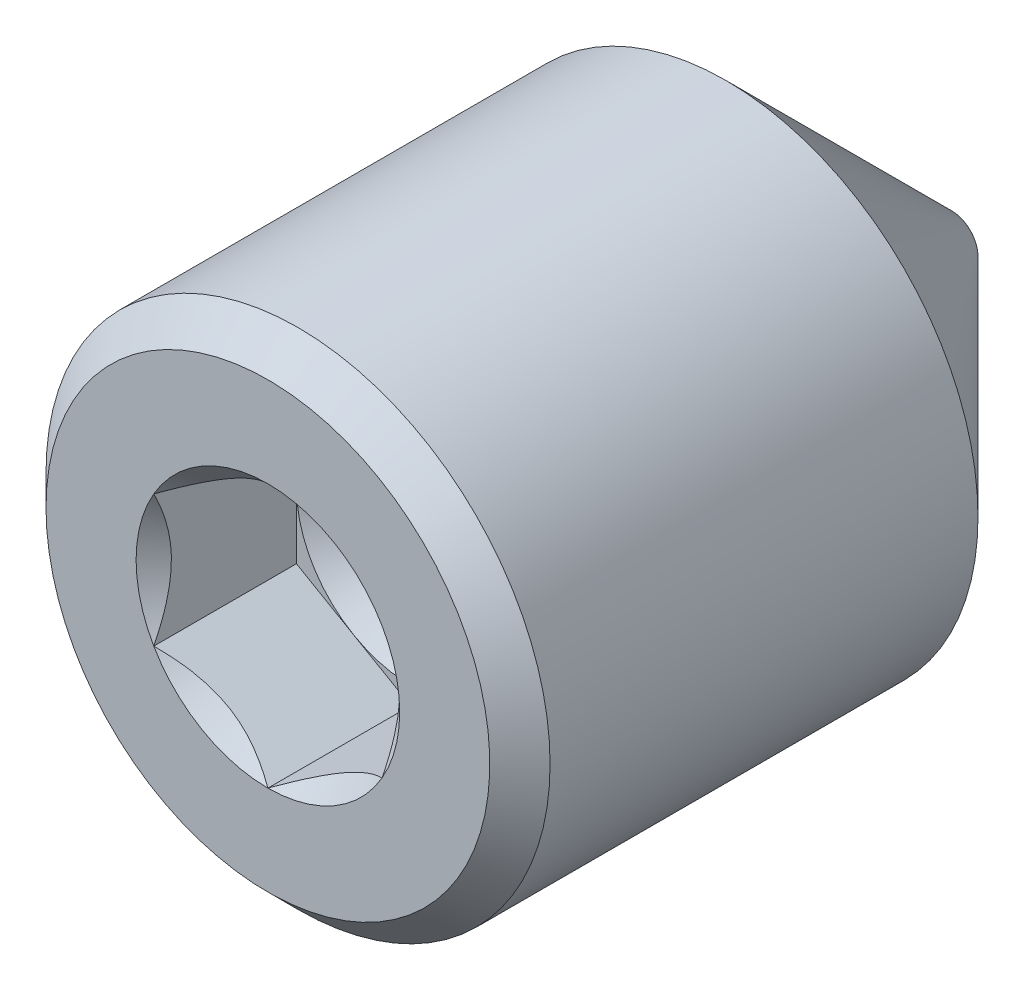
ISO-10303-21;
HEADER;
FILE_DESCRIPTION(('STEP AP214'),'2;1');
FILE_NAME('part.step','',(''),(''),'','','');
FILE_SCHEMA(('AUTOMOTIVE_DESIGN { 1 0 10303 214 1 1 1 1 }'));
ENDSEC;
DATA;
#1=APPLICATION_CONTEXT('core data for automotive mechanical design processes');
#2=APPLICATION_PROTOCOL_DEFINITION('international standard','automotive_design',2000,#1);
#3=PRODUCT_CONTEXT('',#1,'mechanical');
#4=PRODUCT('Part','Part','',(#3));
#5=PRODUCT_RELATED_PRODUCT_CATEGORY('part','',(#4));
#6=PRODUCT_DEFINITION_FORMATION('','',#4);
#7=PRODUCT_DEFINITION_CONTEXT('part definition',#1,'design');
#8=PRODUCT_DEFINITION('design','',#6,#7);
#9=PRODUCT_DEFINITION_SHAPE('','',#8);
#10=(LENGTH_UNIT() NAMED_UNIT(*) SI_UNIT(.MILLI.,.METRE.));
#11=(NAMED_UNIT(*) PLANE_ANGLE_UNIT() SI_UNIT($,.RADIAN.));
#12=(NAMED_UNIT(*) SI_UNIT($,.STERADIAN.) SOLID_ANGLE_UNIT());
#13=UNCERTAINTY_MEASURE_WITH_UNIT(LENGTH_MEASURE(1.E-05),#10,'distance_accuracy_value','');
#14=(GEOMETRIC_REPRESENTATION_CONTEXT(3) GLOBAL_UNCERTAINTY_ASSIGNED_CONTEXT((#13)) GLOBAL_UNIT_ASSIGNED_CONTEXT((#10,
#11,#12)) REPRESENTATION_CONTEXT('',''));
#15=CARTESIAN_POINT('',(0.,0.,0.));
#16=DIRECTION('',(0.,0.,1.));
#17=DIRECTION('',(1.,0.,0.));
#18=AXIS2_PLACEMENT_3D('',#15,#16,#17);
#19=CARTESIAN_POINT('',(0.,0.,1.3890625));
#20=DIRECTION('',(0.,0.,1.));
#21=DIRECTION('',(1.,0.,0.));
#22=AXIS2_PLACEMENT_3D('',#19,#20,#21);
#23=PLANE('',#22);
#24=CARTESIAN_POINT('',(0.,0.,1.3890625));
#25=DIRECTION('',(0.,0.,1.));
#26=DIRECTION('',(1.,0.,0.));
#27=AXIS2_PLACEMENT_3D('',#24,#25,#26);
#28=CIRCLE('',#27,0.793750000000001);
#29=CARTESIAN_POINT('',(0.793750000000002,0.,1.3890625));
#30=VERTEX_POINT('',#29);
#31=CARTESIAN_POINT('',(0.396875,0.687407664253899,1.3890625));
#32=VERTEX_POINT('',#31);
#33=EDGE_CURVE('E120',#30,#32,#28,.T.);
#34=ORIENTED_EDGE('',*,*,#33,.F.);
#35=DIRECTION('',(0.,1.,0.));
#36=VECTOR('',#35,1.);
#37=CARTESIAN_POINT('',(0.793750000000002,-0.458271776169265,1.3890625));
#38=LINE('',#37,#36);
#39=CARTESIAN_POINT('',(0.793750000000002,0.458271776169266,1.3890625));
#40=VERTEX_POINT('',#39);
#41=EDGE_CURVE('E152',#30,#40,#38,.T.);
#42=ORIENTED_EDGE('',*,*,#41,.T.);
#43=DIRECTION('',(-0.866025403784439,0.5,0.));
#44=VECTOR('',#43,1.);
#45=CARTESIAN_POINT('',(0.793750000000002,0.458271776169266,1.3890625));
#46=LINE('',#45,#44);
#47=EDGE_CURVE('E145',#40,#32,#46,.T.);
#48=ORIENTED_EDGE('',*,*,#47,.T.);
#49=EDGE_LOOP('',(#34,#42,#48));
#50=FACE_BOUND('',#49,.T.);
#51=ADVANCED_FACE('F41',(#50),#23,.T.);
#52=CARTESIAN_POINT('',(-0.396875000000001,0.6874076642539,1.3890625));
#53=VERTEX_POINT('',#52);
#54=EDGE_CURVE('E122',#32,#53,#28,.T.);
#55=ORIENTED_EDGE('',*,*,#54,.F.);
#56=CARTESIAN_POINT('',(0.,0.916543552338532,1.3890625));
#57=VERTEX_POINT('',#56);
#58=EDGE_CURVE('E135',#32,#57,#46,.T.);
#59=ORIENTED_EDGE('',*,*,#58,.T.);
#60=DIRECTION('',(-0.866025403784439,-0.5,0.));
#61=VECTOR('',#60,1.);
#62=CARTESIAN_POINT('',(0.,0.916543552338532,1.3890625));
#63=LINE('',#62,#61);
#64=EDGE_CURVE('E138',#57,#53,#63,.T.);
#65=ORIENTED_EDGE('',*,*,#64,.T.);
#66=EDGE_LOOP('',(#55,#59,#65));
#67=FACE_BOUND('',#66,.T.);
#68=ADVANCED_FACE('F134',(#67),#23,.T.);
#69=CARTESIAN_POINT('',(-0.793750000000001,0.,1.3890625));
#70=VERTEX_POINT('',#69);
#71=EDGE_CURVE('E140',#53,#70,#28,.T.);
#72=ORIENTED_EDGE('',*,*,#71,.F.);
#73=CARTESIAN_POINT('',(-0.793750000000001,0.458271776169266,1.3890625));
#74=VERTEX_POINT('',#73);
#75=EDGE_CURVE('E155',#53,#74,#63,.T.);
#76=ORIENTED_EDGE('',*,*,#75,.T.);
#77=DIRECTION('',(0.,-1.,0.));
#78=VECTOR('',#77,1.);
#79=CARTESIAN_POINT('',(-0.793750000000001,0.458271776169266,1.3890625));
#80=LINE('',#79,#78);
#81=EDGE_CURVE('E163',#74,#70,#80,.T.);
#82=ORIENTED_EDGE('',*,*,#81,.T.);
#83=EDGE_LOOP('',(#72,#76,#82));
#84=FACE_BOUND('',#83,.T.);
#85=ADVANCED_FACE('F284',(#84),#23,.T.);
#86=CARTESIAN_POINT('',(-0.396875,-0.687407664253899,1.3890625));
#87=VERTEX_POINT('',#86);
#88=EDGE_CURVE('E309',#70,#87,#28,.T.);
#89=ORIENTED_EDGE('',*,*,#88,.F.);
#90=CARTESIAN_POINT('',(-0.793750000000001,-0.458271776169265,1.3890625));
#91=VERTEX_POINT('',#90);
#92=EDGE_CURVE('E162',#70,#91,#80,.T.);
#93=ORIENTED_EDGE('',*,*,#92,.T.);
#94=DIRECTION('',(0.866025403784439,-0.5,0.));
#95=VECTOR('',#94,1.);
#96=CARTESIAN_POINT('',(-0.793750000000001,-0.458271776169265,1.3890625));
#97=LINE('',#96,#95);
#98=EDGE_CURVE('E313',#91,#87,#97,.T.);
#99=ORIENTED_EDGE('',*,*,#98,.T.);
#100=EDGE_LOOP('',(#89,#93,#99));
#101=FACE_BOUND('',#100,.T.);
#102=ADVANCED_FACE('F292',(#101),#23,.T.);
#103=CARTESIAN_POINT('',(0.396875,-0.687407664253898,1.3890625));
#104=VERTEX_POINT('',#103);
#105=EDGE_CURVE('E57',#87,#104,#28,.T.);
#106=ORIENTED_EDGE('',*,*,#105,.F.);
#107=CARTESIAN_POINT('',(0.,-0.916543552338531,1.3890625));
#108=VERTEX_POINT('',#107);
#109=EDGE_CURVE('E304',#87,#108,#97,.T.);
#110=ORIENTED_EDGE('',*,*,#109,.T.);
#111=DIRECTION('',(0.866025403784438,0.5,0.));
#112=VECTOR('',#111,1.);
#113=CARTESIAN_POINT('',(0.,-0.916543552338531,1.3890625));
#114=LINE('',#113,#112);
#115=EDGE_CURVE('E307',#108,#104,#114,.T.);
#116=ORIENTED_EDGE('',*,*,#115,.T.);
#117=EDGE_LOOP('',(#106,#110,#116));
#118=FACE_BOUND('',#117,.T.);
#119=ADVANCED_FACE('F287',(#118),#23,.T.);
#120=CARTESIAN_POINT('',(0.,1.7526,2.38125));
#121=DIRECTION('',(0.,0.,-1.));
#122=DIRECTION('',(-1.,0.,0.));
#123=AXIS2_PLACEMENT_3D('',#120,#121,#122);
#124=PLANE('',#123);
#125=CARTESIAN_POINT('',(0.,0.,2.38125));
#126=DIRECTION('',(0.,0.,1.));
#127=DIRECTION('',(1.,0.,0.));
#128=AXIS2_PLACEMENT_3D('',#125,#126,#127);
#129=CIRCLE('',#128,0.916543552338532);
#130=CARTESIAN_POINT('',(-0.793750000000001,0.458271776169266,2.38125));
#131=VERTEX_POINT('',#130);
#132=CARTESIAN_POINT('',(-0.793750000000001,-0.458271776169267,2.38125));
#133=VERTEX_POINT('',#132);
#134=EDGE_CURVE('E64',#131,#133,#129,.T.);
#135=ORIENTED_EDGE('',*,*,#134,.F.);
#136=CARTESIAN_POINT('',(0.,0.916543552338532,2.38125));
#137=VERTEX_POINT('',#136);
#138=EDGE_CURVE('E338',#137,#131,#129,.T.);
#139=ORIENTED_EDGE('',*,*,#138,.F.);
#140=CARTESIAN_POINT('',(0.793750000000002,0.458271776169266,2.38125));
#141=VERTEX_POINT('',#140);
#142=EDGE_CURVE('E334',#141,#137,#129,.T.);
#143=ORIENTED_EDGE('',*,*,#142,.F.);
#144=CARTESIAN_POINT('',(0.793750000000003,-0.458271776169264,2.38125));
#145=VERTEX_POINT('',#144);
#146=EDGE_CURVE('E129',#145,#141,#129,.T.);
#147=ORIENTED_EDGE('',*,*,#146,.F.);
#148=CARTESIAN_POINT('',(0.,-0.916543552338532,2.38125));
#149=VERTEX_POINT('',#148);
#150=EDGE_CURVE('E345',#149,#145,#129,.T.);
#151=ORIENTED_EDGE('',*,*,#150,.F.);
#152=EDGE_CURVE('E349',#133,#149,#129,.T.);
#153=ORIENTED_EDGE('',*,*,#152,.F.);
#154=EDGE_LOOP('',(#135,#139,#143,#147,#151,#153));
#155=FACE_BOUND('',#154,.T.);
#156=CARTESIAN_POINT('',(0.,0.,2.38125));
#157=DIRECTION('',(0.,0.,-1.));
#158=DIRECTION('',(-1.,0.,0.));
#159=AXIS2_PLACEMENT_3D('',#156,#157,#158);
#160=CIRCLE('',#159,1.54305);
#161=CARTESIAN_POINT('',(-1.54305,0.,2.38125));
#162=VERTEX_POINT('',#161);
#163=EDGE_CURVE('E191',#162,#162,#160,.F.);
#164=ORIENTED_EDGE('',*,*,#163,.T.);
#165=EDGE_LOOP('',(#164));
#166=FACE_BOUND('',#165,.T.);
#167=ADVANCED_FACE('F291',(#155,#166),#124,.F.);
#168=CARTESIAN_POINT('',(0.,0.,-2.38125));
#169=DIRECTION('',(0.,0.,1.));
#170=DIRECTION('',(1.,0.,0.));
#171=AXIS2_PLACEMENT_3D('',#168,#169,#170);
#172=PLANE('',#171);
#173=CARTESIAN_POINT('',(0.,0.,-2.38125));
#174=DIRECTION('',(0.,0.,1.));
#175=DIRECTION('',(1.,0.,0.));
#176=AXIS2_PLACEMENT_3D('',#173,#174,#175);
#177=CIRCLE('',#176,0.160740986211698);
#178=CARTESIAN_POINT('',(0.160740986211698,0.,-2.38125));
#179=VERTEX_POINT('',#178);
#180=EDGE_CURVE('E11',#179,#179,#177,.F.);
#181=ORIENTED_EDGE('',*,*,#180,.T.);
#182=EDGE_LOOP('',(#181));
#183=FACE_BOUND('',#182,.T.);
#184=ADVANCED_FACE('F298',(#183),#172,.F.);
#185=CARTESIAN_POINT('',(0.,0.,-2.38125));
#186=DIRECTION('',(0.,0.,1.));
#187=DIRECTION('',(1.,0.,0.));
#188=AXIS2_PLACEMENT_3D('',#185,#186,#187);
#189=CONICAL_SURFACE('',#188,0.17526,0.78539816339745);
#190=CARTESIAN_POINT('',(0.,0.,-2.37098350689415));
#191=DIRECTION('',(0.,0.,-1.));
#192=DIRECTION('',(-1.,0.,0.));
#193=AXIS2_PLACEMENT_3D('',#190,#191,#192);
#194=CIRCLE('',#193,0.185526493105849);
#195=CARTESIAN_POINT('',(0.185526493105849,0.,-2.37098350689415));
#196=VERTEX_POINT('',#195);
#197=EDGE_CURVE('E50',#196,#196,#194,.F.);
#198=CARTESIAN_POINT('',(0.,0.,-0.803910000000005));
#199=DIRECTION('',(0.,0.,1.));
#200=DIRECTION('',(1.,0.,0.));
#201=AXIS2_PLACEMENT_3D('',#198,#199,#200);
#202=CIRCLE('',#201,1.7526);
#203=CARTESIAN_POINT('',(1.7526,0.,-0.803910000000005));
#204=VERTEX_POINT('',#203);
#205=EDGE_CURVE('E172',#204,#204,#202,.T.);
#206=CARTESIAN_POINT('',(0.185526493105849,0.,-2.37098350689415));
#207=CARTESIAN_POINT('',(0.20185017546933,0.,-2.35465982453067));
#208=CARTESIAN_POINT('',(0.218173857832811,0.,-2.33833614216719));
#209=CARTESIAN_POINT('',(0.250821222559772,0.,-2.30568877744023));
#210=CARTESIAN_POINT('',(0.267144904923253,0.,-2.28936509507675));
#211=CARTESIAN_POINT('',(0.299792269650215,0.,-2.25671773034979));
#212=CARTESIAN_POINT('',(0.316115952013695,0.,-2.24039404798631));
#213=CARTESIAN_POINT('',(0.348763316740657,0.,-2.20774668325934));
#214=CARTESIAN_POINT('',(0.365086999104138,0.,-2.19142300089586));
#215=CARTESIAN_POINT('',(0.397734363831099,0.,-2.1587756361689));
#216=CARTESIAN_POINT('',(0.41405804619458,0.,-2.14245195380542));
#217=CARTESIAN_POINT('',(0.446705410921541,0.,-2.10980458907846));
#218=CARTESIAN_POINT('',(0.463029093285022,0.,-2.09348090671498));
#219=CARTESIAN_POINT('',(0.495676458011984,0.,-2.06083354198802));
#220=CARTESIAN_POINT('',(0.512000140375464,0.,-2.04450985962454));
#221=CARTESIAN_POINT('',(0.544647505102426,0.,-2.01186249489758));
#222=CARTESIAN_POINT('',(0.560971187465906,0.,-1.99553881253409));
#223=CARTESIAN_POINT('',(0.593618552192868,0.,-1.96289144780713));
#224=CARTESIAN_POINT('',(0.609942234556349,0.,-1.94656776544365));
#225=CARTESIAN_POINT('',(0.64258959928331,0.,-1.91392040071669));
#226=CARTESIAN_POINT('',(0.658913281646791,0.,-1.89759671835321));
#227=CARTESIAN_POINT('',(0.691560646373752,0.,-1.86494935362625));
#228=CARTESIAN_POINT('',(0.707884328737233,0.,-1.84862567126277));
#229=CARTESIAN_POINT('',(0.740531693464195,0.,-1.81597830653581));
#230=CARTESIAN_POINT('',(0.756855375827675,0.,-1.79965462417233));
#231=CARTESIAN_POINT('',(0.789502740554637,0.,-1.76700725944537));
#232=CARTESIAN_POINT('',(0.805826422918118,0.,-1.75068357708188));
#233=CARTESIAN_POINT('',(0.838473787645079,0.,-1.71803621235492));
#234=CARTESIAN_POINT('',(0.85479747000856,0.,-1.70171252999144));
#235=CARTESIAN_POINT('',(0.887444834735521,0.,-1.66906516526448));
#236=CARTESIAN_POINT('',(0.903768517099002,0.,-1.652741482901));
#237=CARTESIAN_POINT('',(0.936415881825963,0.,-1.62009411817404));
#238=CARTESIAN_POINT('',(0.952739564189444,0.,-1.60377043581056));
#239=CARTESIAN_POINT('',(0.985386928916406,0.,-1.5711230710836));
#240=CARTESIAN_POINT('',(1.00171061127989,0.,-1.55479938872012));
#241=CARTESIAN_POINT('',(1.03435797600685,0.,-1.52215202399315));
#242=CARTESIAN_POINT('',(1.05068165837033,0.,-1.50582834162967));
#243=CARTESIAN_POINT('',(1.08332902309729,0.,-1.47318097690271));
#244=CARTESIAN_POINT('',(1.09965270546077,0.,-1.45685729453923));
#245=CARTESIAN_POINT('',(1.13230007018773,0.,-1.42420992981227));
#246=CARTESIAN_POINT('',(1.14862375255121,0.,-1.40788624744879));
#247=CARTESIAN_POINT('',(1.18127111727817,0.,-1.37523888272183));
#248=CARTESIAN_POINT('',(1.19759479964166,0.,-1.35891520035835));
#249=CARTESIAN_POINT('',(1.23024216436862,0.,-1.32626783563139));
#250=CARTESIAN_POINT('',(1.2465658467321,0.,-1.30994415326791));
#251=CARTESIAN_POINT('',(1.27921321145906,0.,-1.27729678854094));
#252=CARTESIAN_POINT('',(1.29553689382254,0.,-1.26097310617746));
#253=CARTESIAN_POINT('',(1.3281842585495,0.,-1.2283257414505));
#254=CARTESIAN_POINT('',(1.34450794091298,0.,-1.21200205908702));
#255=CARTESIAN_POINT('',(1.37715530563994,0.,-1.17935469436006));
#256=CARTESIAN_POINT('',(1.39347898800342,0.,-1.16303101199658));
#257=CARTESIAN_POINT('',(1.42612635273039,0.,-1.13038364726962));
#258=CARTESIAN_POINT('',(1.44245003509387,0.,-1.11405996490614));
#259=CARTESIAN_POINT('',(1.47509739982083,0.,-1.08141260017918));
#260=CARTESIAN_POINT('',(1.49142108218431,0.,-1.0650889178157));
#261=CARTESIAN_POINT('',(1.52406844691127,0.,-1.03244155308873));
#262=CARTESIAN_POINT('',(1.54039212927475,0.,-1.01611787072525));
#263=CARTESIAN_POINT('',(1.57303949400171,0.,-0.983470505998292));
#264=CARTESIAN_POINT('',(1.58936317636519,0.,-0.967146823634812));
#265=CARTESIAN_POINT('',(1.62201054109215,0.,-0.93449945890785));
#266=CARTESIAN_POINT('',(1.63833422345564,0.,-0.91817577654437));
#267=CARTESIAN_POINT('',(1.6709815881826,0.,-0.885528411817408));
#268=CARTESIAN_POINT('',(1.68730527054608,0.,-0.869204729453928));
#269=CARTESIAN_POINT('',(1.71995263527304,0.,-0.836557364726966));
#270=CARTESIAN_POINT('',(1.73627631763652,0.,-0.820233682363486));
#271=CARTESIAN_POINT('',(1.7526,0.,-0.803910000000005));
#272=B_SPLINE_CURVE_WITH_KNOTS('',3,(#206,#207,#208,#209,#210,#211,#212,#213,#214,#215,#216,
#217,#218,#219,#220,#221,#222,#223,#224,#225,#226,#227,#228,#229,#230,#231,#232,#233,#234,#235,
#236,#237,#238,#239,#240,#241,#242,#243,#244,#245,#246,#247,#248,#249,#250,#251,#252,#253,#254,
#255,#256,#257,#258,#259,#260,#261,#262,#263,#264,#265,#266,#267,#268,#269,#270,#271),
.UNSPECIFIED.,.F.,.F.,(4,2,2,2,2,2,2,2,2,2,2,2,2,2,2,2,2,2,2,2,2,2,2,2,2,2,2,2,2,2,2,2,4),(0.,
0.0692555189589149,0.13851103791783,0.207766556876745,0.277022075835659,0.346277594794574,
0.415533113753489,0.484788632712404,0.554044151671318,0.623299670630233,0.692555189589148,
0.761810708548063,0.831066227506977,0.900321746465892,0.969577265424807,1.03883278438372,
1.10808830334264,1.17734382230155,1.24659934126047,1.31585486021938,1.3851103791783,
1.45436589813721,1.52362141709612,1.59287693605504,1.66213245501395,1.73138797397287,
1.80064349293178,1.8698990118907,1.93915453084961,2.00841004980853,2.07766556876744,
2.14692108772636,2.21617660668527),.UNSPECIFIED.);
#273=EDGE_CURVE('BSEAM386',#196,#204,#272,.T.);
#274=ORIENTED_EDGE('',*,*,#197,.T.);
#275=ORIENTED_EDGE('',*,*,#205,.F.);
#276=ORIENTED_EDGE('',*,*,#273,.T.);
#277=ORIENTED_EDGE('',*,*,#273,.F.);
#278=EDGE_LOOP('',(#274,#276,#275,#277));
#279=FACE_BOUND('',#278,.T.);
#280=ADVANCED_FACE('F386',(#279),#189,.T.);
#281=CARTESIAN_POINT('',(0.,0.,2.38125));
#282=DIRECTION('',(0.,0.,1.));
#283=DIRECTION('',(1.,0.,0.));
#284=AXIS2_PLACEMENT_3D('',#281,#282,#283);
#285=CYLINDRICAL_SURFACE('',#284,1.7526);
#286=CARTESIAN_POINT('',(0.,0.,2.1717));
#287=DIRECTION('',(0.,0.,-1.));
#288=DIRECTION('',(-1.,0.,0.));
#289=AXIS2_PLACEMENT_3D('',#286,#287,#288);
#290=CIRCLE('',#289,1.7526);
#291=CARTESIAN_POINT('',(-1.7526,0.,2.1717));
#292=VERTEX_POINT('',#291);
#293=EDGE_CURVE('E195',#292,#292,#290,.T.);
#294=ORIENTED_EDGE('',*,*,#293,.T.);
#295=EDGE_LOOP('',(#294));
#296=FACE_BOUND('',#295,.T.);
#297=ORIENTED_EDGE('',*,*,#205,.T.);
#298=EDGE_LOOP('',(#297));
#299=FACE_BOUND('',#298,.T.);
#300=ADVANCED_FACE('F381',(#296,#299),#285,.T.);
#301=CARTESIAN_POINT('',(0.,0.,2.38125));
#302=DIRECTION('',(0.,0.,-1.));
#303=DIRECTION('',(-1.,0.,0.));
#304=AXIS2_PLACEMENT_3D('',#301,#302,#303);
#305=CONICAL_SURFACE('',#304,1.54305,0.785398163397447);
#306=ORIENTED_EDGE('',*,*,#293,.F.);
#307=EDGE_LOOP('',(#306));
#308=FACE_BOUND('',#307,.T.);
#309=ORIENTED_EDGE('',*,*,#163,.F.);
#310=EDGE_LOOP('',(#309));
#311=FACE_BOUND('',#310,.T.);
#312=ADVANCED_FACE('F377',(#308,#311),#305,.T.);
#313=CARTESIAN_POINT('',(0.,0.,2.38125));
#314=DIRECTION('',(0.,0.,1.));
#315=DIRECTION('',(1.,0.,0.));
#316=AXIS2_PLACEMENT_3D('',#313,#314,#315);
#317=CONICAL_SURFACE('',#316,0.916543552338532,0.78539816339745);
#318=ORIENTED_EDGE('',*,*,#150,.T.);
#319=CARTESIAN_POINT('',(-0.000199999999999565,-0.916659022392369,2.3813654918722));
#320=CARTESIAN_POINT('',(0.0270936731709002,-0.900901012839976,2.36561677881996));
#321=CARTESIAN_POINT('',(0.0548437622982915,-0.884879491412241,2.35079254758418));
#322=CARTESIAN_POINT('',(0.11142974953684,-0.852209556447704,2.32364903778594));
#323=CARTESIAN_POINT('',(0.140271036646689,-0.835558031571058,2.31134487372838));
#324=CARTESIAN_POINT('',(0.198428320979555,-0.801980907806139,2.29026736657059));
#325=CARTESIAN_POINT('',(0.22772948520278,-0.785063872754291,2.28144100814755));
#326=CARTESIAN_POINT('',(0.286976842886977,-0.750857394846546,2.26784123872424));
#327=CARTESIAN_POINT('',(0.316921224361638,-0.733568998141434,2.26305766812998));
#328=CARTESIAN_POINT('',(0.368524622466453,-0.703775762354519,2.25874340945594));
#329=CARTESIAN_POINT('',(0.390116468258512,-0.691309704374173,2.25810527141097));
#330=CARTESIAN_POINT('',(0.433258367277032,-0.666401717362479,2.25917613979119));
#331=CARTESIAN_POINT('',(0.454808410236485,-0.653959794258791,2.26088566388179));
#332=CARTESIAN_POINT('',(0.519150845544783,-0.616811671913228,2.26942279115859));
#333=CARTESIAN_POINT('',(0.561623053980696,-0.592290330939676,2.27965991913679));
#334=CARTESIAN_POINT('',(0.636174390780282,-0.549248096569989,2.30436858984055));
#335=CARTESIAN_POINT('',(0.668602787817668,-0.530525552811066,2.31754617467531));
#336=CARTESIAN_POINT('',(0.732189146461485,-0.49381395153127,2.34723103995168));
#337=CARTESIAN_POINT('',(0.763350854631518,-0.475822730930893,2.36372748789317));
#338=CARTESIAN_POINT('',(0.793950000000001,-0.458156306115427,2.3813654918722));
#339=B_SPLINE_CURVE_WITH_KNOTS('',3,(#319,#320,#321,#322,#323,#324,#325,#326,#327,#328,#329,
#330,#331,#332,#333,#334,#335,#336,#337,#338),.UNSPECIFIED.,.F.,.F.,(4,2,2,2,2,2,2,2,2,4),(0.,
0.105768699105621,0.21215429718622,0.316848842533859,0.421279499712346,0.495991864977074,
0.570720707151283,0.720221070373884,0.839150369964802,0.957697614118392),.UNSPECIFIED.);
#340=EDGE_CURVE('E199',#149,#145,#339,.T.);
#341=ORIENTED_EDGE('',*,*,#340,.F.);
#342=EDGE_LOOP('',(#318,#341));
#343=FACE_BOUND('',#342,.T.);
#344=ADVANCED_FACE('F219',(#343),#317,.F.);
#345=ORIENTED_EDGE('',*,*,#146,.T.);
#346=CARTESIAN_POINT('',(0.793750000000002,-0.913980968631288,2.67524363152663));
#347=CARTESIAN_POINT('',(0.793750000000002,-0.891726118408807,2.65844331139992));
#348=CARTESIAN_POINT('',(0.793750000000002,-0.869347264752246,2.64180771816471));
#349=CARTESIAN_POINT('',(0.793750000000002,-0.824291242927396,2.60893403014944));
#350=CARTESIAN_POINT('',(0.793750000000002,-0.801614001790184,2.59269603548549));
#351=CARTESIAN_POINT('',(0.793750000000002,-0.732727209876546,2.54444880599546));
#352=CARTESIAN_POINT('',(0.793750000000002,-0.686000956667988,2.51316508173973));
#353=CARTESIAN_POINT('',(0.793750000000002,-0.588017824995772,2.4517514022072));
#354=CARTESIAN_POINT('',(0.793750000000002,-0.536654577529102,2.42178922479031));
#355=CARTESIAN_POINT('',(0.793750000000002,-0.431362595356819,2.36698201637551));
#356=CARTESIAN_POINT('',(0.793750000000002,-0.377443295121879,2.34211973462839));
#357=CARTESIAN_POINT('',(0.793750000000002,-0.296509956225309,2.31170303697754));
#358=CARTESIAN_POINT('',(0.793750000000002,-0.270694141865805,2.30297322583388));
#359=CARTESIAN_POINT('',(0.793750000000002,-0.218439268933229,2.28758618411155));
#360=CARTESIAN_POINT('',(0.793750000000002,-0.192000167559263,2.28092909631462));
#361=CARTESIAN_POINT('',(0.793750000000002,-0.139102716883655,2.27014501883097));
#362=CARTESIAN_POINT('',(0.793750000000002,-0.112653420625715,2.26597431474817));
#363=CARTESIAN_POINT('',(0.793750000000002,-0.0594633329067011,2.26024177038961));
#364=CARTESIAN_POINT('',(0.793750000000002,-0.032722497613478,2.25868032800956));
#365=CARTESIAN_POINT('',(0.793750000000002,0.0198050551458946,2.2582848281083));
#366=CARTESIAN_POINT('',(0.793750000000002,0.0455910743709448,2.2593535689657));
#367=CARTESIAN_POINT('',(0.793750000000002,0.0969445863288124,2.26394535251381));
#368=CARTESIAN_POINT('',(0.793750000000002,0.122512036243235,2.26746886543208));
#369=CARTESIAN_POINT('',(0.793750000000002,0.173672423437556,2.27683760806234));
#370=CARTESIAN_POINT('',(0.793750000000002,0.199258034738771,2.2827222417117));
#371=CARTESIAN_POINT('',(0.793750000000002,0.249870222787764,2.29650047334592));
#372=CARTESIAN_POINT('',(0.793750000000002,0.274896846121588,2.30439390323309));
#373=CARTESIAN_POINT('',(0.793750000000002,0.353690387308578,2.33221488909149));
#374=CARTESIAN_POINT('',(0.793750000000002,0.406335817172576,2.35531093127087));
#375=CARTESIAN_POINT('',(0.793750000000002,0.509153512732666,2.40666216798862));
#376=CARTESIAN_POINT('',(0.793750000000002,0.559316043114032,2.43493589778055));
#377=CARTESIAN_POINT('',(0.793750000000002,0.655183864128668,2.49326709668194));
#378=CARTESIAN_POINT('',(0.793750000000002,0.70098677738038,2.52316610803635));
#379=CARTESIAN_POINT('',(0.793750000000002,0.76846815262284,2.56938688952484));
#380=CARTESIAN_POINT('',(0.793750000000002,0.790670702736773,2.58495679013737));
#381=CARTESIAN_POINT('',(0.793750000000002,0.834772410733673,2.61650838541678));
#382=CARTESIAN_POINT('',(0.793750000000002,0.856671649924405,2.63248996630662));
#383=CARTESIAN_POINT('',(0.793750000000002,0.878444596186491,2.64864224451417));
#384=B_SPLINE_CURVE_WITH_KNOTS('',3,(#346,#347,#348,#349,#350,#351,#352,#353,#354,#355,#356,
#357,#358,#359,#360,#361,#362,#363,#364,#365,#366,#367,#368,#369,#370,#371,#372,#373,#374,#375,
#376,#377,#378,#379,#380,#381,#382,#383),.UNSPECIFIED.,.F.,.F.,(4,2,2,2,2,2,2,2,2,2,2,2,2,2,2,2,
2,2,4),(0.,0.0836505018973623,0.167321854943287,0.335941679180091,0.514186123096124,
0.69181732170502,0.773503877631502,0.855196059378409,0.935406023862936,1.01562821873761,
1.09293052027313,1.17024763364031,1.24891262600271,1.32757103777814,1.49953149859345,
1.67212003011421,1.83613214185177,1.91748242827299,1.99881046796338),.UNSPECIFIED.);
#385=EDGE_CURVE('E227',#145,#141,#384,.T.);
#386=ORIENTED_EDGE('',*,*,#385,.F.);
#387=EDGE_LOOP('',(#345,#386));
#388=FACE_BOUND('',#387,.T.);
#389=ADVANCED_FACE('F370',(#388),#317,.F.);
#390=ORIENTED_EDGE('',*,*,#142,.T.);
#391=CARTESIAN_POINT('',(0.793950000000001,0.458156306115428,2.3813654918722));
#392=CARTESIAN_POINT('',(0.766656326829102,0.473914315667821,2.36561677881996));
#393=CARTESIAN_POINT('',(0.73890623770171,0.489935837095556,2.35079254758418));
#394=CARTESIAN_POINT('',(0.682320250463161,0.522605772060093,2.32364903778594));
#395=CARTESIAN_POINT('',(0.653478963353313,0.539257296936739,2.31134487372838));
#396=CARTESIAN_POINT('',(0.595321679020446,0.572834420701658,2.2902673665706));
#397=CARTESIAN_POINT('',(0.566020514797221,0.589751455753506,2.28144100814755));
#398=CARTESIAN_POINT('',(0.506773157113024,0.623957933661251,2.26784123872424));
#399=CARTESIAN_POINT('',(0.476828775638363,0.641246330366363,2.26305766812998));
#400=CARTESIAN_POINT('',(0.425225377533548,0.671039566153278,2.25874340945595));
#401=CARTESIAN_POINT('',(0.403633531741489,0.683505624133624,2.25810527141097));
#402=CARTESIAN_POINT('',(0.360491632722969,0.708413611145318,2.25917613979119));
#403=CARTESIAN_POINT('',(0.338941589763515,0.720855534249007,2.26088566388179));
#404=CARTESIAN_POINT('',(0.274599154455217,0.758003656594569,2.26942279115859));
#405=CARTESIAN_POINT('',(0.232126946019305,0.78252499756812,2.27965991913679));
#406=CARTESIAN_POINT('',(0.157575609219718,0.825567231937808,2.30436858984055));
#407=CARTESIAN_POINT('',(0.125147212182333,0.844289775696731,2.31754617467531));
#408=CARTESIAN_POINT('',(0.0615608535385162,0.881001376976527,2.34723103995168));
#409=CARTESIAN_POINT('',(0.0303991453684826,0.898992597576904,2.36372748789317));
#410=CARTESIAN_POINT('',(-0.000200000000000456,0.91665902239237,2.3813654918722));
#411=B_SPLINE_CURVE_WITH_KNOTS('',3,(#391,#392,#393,#394,#395,#396,#397,#398,#399,#400,#401,
#402,#403,#404,#405,#406,#407,#408,#409,#410),.UNSPECIFIED.,.F.,.F.,(4,2,2,2,2,2,2,2,2,4),(0.,
0.105768699105622,0.212154297186221,0.31684884253386,0.421279499712347,0.495991864977075,
0.570720707151285,0.720221070373885,0.839150369964803,0.957697614118393),.UNSPECIFIED.);
#412=EDGE_CURVE('E235',#141,#137,#411,.T.);
#413=ORIENTED_EDGE('',*,*,#412,.F.);
#414=EDGE_LOOP('',(#390,#413));
#415=FACE_BOUND('',#414,.T.);
#416=ADVANCED_FACE('F365',(#415),#317,.F.);
#417=ORIENTED_EDGE('',*,*,#138,.T.);
#418=CARTESIAN_POINT('',(0.000199999999999632,0.91665902239237,2.3813654918722));
#419=CARTESIAN_POINT('',(-0.0270936731709002,0.900901012839977,2.36561677881996));
#420=CARTESIAN_POINT('',(-0.0548437622982916,0.884879491412242,2.35079254758418));
#421=CARTESIAN_POINT('',(-0.11142974953684,0.852209556447705,2.32364903778594));
#422=CARTESIAN_POINT('',(-0.140271036646689,0.835558031571059,2.31134487372838));
#423=CARTESIAN_POINT('',(-0.198428320979556,0.80198090780614,2.2902673665706));
#424=CARTESIAN_POINT('',(-0.227729485202781,0.785063872754292,2.28144100814755));
#425=CARTESIAN_POINT('',(-0.286976842886977,0.750857394846547,2.26784123872424));
#426=CARTESIAN_POINT('',(-0.316921224361638,0.733568998141435,2.26305766812998));
#427=CARTESIAN_POINT('',(-0.368524622466453,0.70377576235452,2.25874340945595));
#428=CARTESIAN_POINT('',(-0.390116468258513,0.691309704374174,2.25810527141097));
#429=CARTESIAN_POINT('',(-0.433258367277033,0.66640171736248,2.25917613979119));
#430=CARTESIAN_POINT('',(-0.454808410236486,0.653959794258791,2.26088566388179));
#431=CARTESIAN_POINT('',(-0.519150845544785,0.616811671913229,2.26942279115859));
#432=CARTESIAN_POINT('',(-0.561623053980697,0.592290330939677,2.27965991913679));
#433=CARTESIAN_POINT('',(-0.636174390780283,0.54924809656999,2.30436858984055));
#434=CARTESIAN_POINT('',(-0.668602787817669,0.530525552811067,2.31754617467531));
#435=CARTESIAN_POINT('',(-0.732189146461485,0.493813951531272,2.34723103995168));
#436=CARTESIAN_POINT('',(-0.763350854631518,0.475822730930895,2.36372748789317));
#437=CARTESIAN_POINT('',(-0.793950000000001,0.458156306115428,2.3813654918722));
#438=B_SPLINE_CURVE_WITH_KNOTS('',3,(#418,#419,#420,#421,#422,#423,#424,#425,#426,#427,#428,
#429,#430,#431,#432,#433,#434,#435,#436,#437),.UNSPECIFIED.,.F.,.F.,(4,2,2,2,2,2,2,2,2,4),(0.,
0.105768699105622,0.21215429718622,0.316848842533859,0.421279499712347,0.495991864977075,
0.570720707151284,0.720221070373885,0.839150369964802,0.957697614118392),.UNSPECIFIED.);
#439=EDGE_CURVE('E242',#137,#131,#438,.T.);
#440=ORIENTED_EDGE('',*,*,#439,.F.);
#441=EDGE_LOOP('',(#417,#440));
#442=FACE_BOUND('',#441,.T.);
#443=ADVANCED_FACE('F363',(#442),#317,.F.);
#444=ORIENTED_EDGE('',*,*,#134,.T.);
#445=CARTESIAN_POINT('',(-0.793750000000001,-0.913980968631289,2.67524363152663));
#446=CARTESIAN_POINT('',(-0.793750000000001,-0.891726118408808,2.65844331139992));
#447=CARTESIAN_POINT('',(-0.793750000000001,-0.869347264752247,2.64180771816471));
#448=CARTESIAN_POINT('',(-0.793750000000001,-0.824291242927397,2.60893403014944));
#449=CARTESIAN_POINT('',(-0.793750000000001,-0.801614001790186,2.59269603548549));
#450=CARTESIAN_POINT('',(-0.793750000000001,-0.732727209876547,2.54444880599546));
#451=CARTESIAN_POINT('',(-0.793750000000001,-0.686000956667989,2.51316508173973));
#452=CARTESIAN_POINT('',(-0.793750000000001,-0.588017824995774,2.4517514022072));
#453=CARTESIAN_POINT('',(-0.793750000000001,-0.536654577529103,2.42178922479031));
#454=CARTESIAN_POINT('',(-0.793750000000001,-0.43136259535682,2.36698201637551));
#455=CARTESIAN_POINT('',(-0.793750000000001,-0.37744329512188,2.34211973462839));
#456=CARTESIAN_POINT('',(-0.793750000000001,-0.29650995622531,2.31170303697754));
#457=CARTESIAN_POINT('',(-0.793750000000001,-0.270694141865806,2.30297322583388));
#458=CARTESIAN_POINT('',(-0.793750000000001,-0.21843926893323,2.28758618411155));
#459=CARTESIAN_POINT('',(-0.793750000000001,-0.192000167559264,2.28092909631462));
#460=CARTESIAN_POINT('',(-0.793750000000001,-0.139102716883656,2.27014501883097));
#461=CARTESIAN_POINT('',(-0.793750000000001,-0.112653420625716,2.26597431474817));
#462=CARTESIAN_POINT('',(-0.793750000000001,-0.0594633329067021,2.26024177038961));
#463=CARTESIAN_POINT('',(-0.793750000000001,-0.032722497613479,2.25868032800956));
#464=CARTESIAN_POINT('',(-0.793750000000001,0.0198050551458937,2.2582848281083));
#465=CARTESIAN_POINT('',(-0.793750000000001,0.0455910743709439,2.2593535689657));
#466=CARTESIAN_POINT('',(-0.793750000000001,0.0969445863288115,2.26394535251381));
#467=CARTESIAN_POINT('',(-0.793750000000001,0.122512036243234,2.26746886543208));
#468=CARTESIAN_POINT('',(-0.793750000000001,0.173672423437556,2.27683760806234));
#469=CARTESIAN_POINT('',(-0.793750000000001,0.199258034738771,2.2827222417117));
#470=CARTESIAN_POINT('',(-0.793750000000001,0.249870222787764,2.29650047334592));
#471=CARTESIAN_POINT('',(-0.793750000000001,0.274896846121587,2.30439390323309));
#472=CARTESIAN_POINT('',(-0.793750000000001,0.353690387308577,2.33221488909149));
#473=CARTESIAN_POINT('',(-0.793750000000001,0.406335817172575,2.35531093127087));
#474=CARTESIAN_POINT('',(-0.793750000000001,0.509153512732665,2.40666216798862));
#475=CARTESIAN_POINT('',(-0.793750000000001,0.559316043114032,2.43493589778055));
#476=CARTESIAN_POINT('',(-0.793750000000001,0.655183864128668,2.49326709668194));
#477=CARTESIAN_POINT('',(-0.793750000000001,0.700986777380379,2.52316610803635));
#478=CARTESIAN_POINT('',(-0.793750000000001,0.768468152622839,2.56938688952484));
#479=CARTESIAN_POINT('',(-0.793750000000001,0.790670702736772,2.58495679013737));
#480=CARTESIAN_POINT('',(-0.793750000000001,0.834772410733672,2.61650838541678));
#481=CARTESIAN_POINT('',(-0.793750000000001,0.856671649924404,2.63248996630662));
#482=CARTESIAN_POINT('',(-0.793750000000001,0.87844459618649,2.64864224451417));
#483=B_SPLINE_CURVE_WITH_KNOTS('',3,(#445,#446,#447,#448,#449,#450,#451,#452,#453,#454,#455,
#456,#457,#458,#459,#460,#461,#462,#463,#464,#465,#466,#467,#468,#469,#470,#471,#472,#473,#474,
#475,#476,#477,#478,#479,#480,#481,#482),.UNSPECIFIED.,.F.,.F.,(4,2,2,2,2,2,2,2,2,2,2,2,2,2,2,2,
2,2,4),(0.,0.0836505018973619,0.167321854943286,0.335941679180091,0.514186123096124,
0.691817321705021,0.773503877631502,0.855196059378409,0.935406023862936,1.01562821873761,
1.09293052027313,1.17024763364031,1.24891262600271,1.32757103777814,1.49953149859345,
1.67212003011421,1.83613214185177,1.91748242827299,1.99881046796338),.UNSPECIFIED.);
#484=EDGE_CURVE('E249',#131,#133,#483,.F.);
#485=ORIENTED_EDGE('',*,*,#484,.F.);
#486=EDGE_LOOP('',(#444,#485));
#487=FACE_BOUND('',#486,.T.);
#488=ADVANCED_FACE('F217',(#487),#317,.F.);
#489=ORIENTED_EDGE('',*,*,#152,.T.);
#490=CARTESIAN_POINT('',(-0.793950000000001,-0.458156306115427,2.3813654918722));
#491=CARTESIAN_POINT('',(-0.766656326829101,-0.47391431566782,2.36561677881996));
#492=CARTESIAN_POINT('',(-0.738906237701709,-0.489935837095556,2.35079254758418));
#493=CARTESIAN_POINT('',(-0.682320250463161,-0.522605772060093,2.32364903778594));
#494=CARTESIAN_POINT('',(-0.653478963353312,-0.539257296936739,2.31134487372838));
#495=CARTESIAN_POINT('',(-0.595321679020445,-0.572834420701657,2.29026736657059));
#496=CARTESIAN_POINT('',(-0.56602051479722,-0.589751455753505,2.28144100814755));
#497=CARTESIAN_POINT('',(-0.506773157113024,-0.62395793366125,2.26784123872424));
#498=CARTESIAN_POINT('',(-0.476828775638363,-0.641246330366363,2.26305766812998));
#499=CARTESIAN_POINT('',(-0.425225377533548,-0.671039566153277,2.25874340945594));
#500=CARTESIAN_POINT('',(-0.403633531741488,-0.683505624133623,2.25810527141097));
#501=CARTESIAN_POINT('',(-0.360491632722968,-0.708413611145317,2.25917613979119));
#502=CARTESIAN_POINT('',(-0.338941589763515,-0.720855534249006,2.26088566388179));
#503=CARTESIAN_POINT('',(-0.274599154455217,-0.758003656594567,2.26942279115859));
#504=CARTESIAN_POINT('',(-0.232126946019305,-0.782524997568119,2.27965991913679));
#505=CARTESIAN_POINT('',(-0.157575609219718,-0.825567231937807,2.30436858984055));
#506=CARTESIAN_POINT('',(-0.125147212182333,-0.84428977569673,2.31754617467531));
#507=CARTESIAN_POINT('',(-0.0615608535385162,-0.881001376976525,2.34723103995168));
#508=CARTESIAN_POINT('',(-0.0303991453684827,-0.898992597576903,2.36372748789317));
#509=CARTESIAN_POINT('',(0.000200000000000415,-0.916659022392369,2.3813654918722));
#510=B_SPLINE_CURVE_WITH_KNOTS('',3,(#490,#491,#492,#493,#494,#495,#496,#497,#498,#499,#500,
#501,#502,#503,#504,#505,#506,#507,#508,#509),.UNSPECIFIED.,.F.,.F.,(4,2,2,2,2,2,2,2,2,4),(0.,
0.105768699105622,0.212154297186221,0.31684884253386,0.421279499712347,0.495991864977075,
0.570720707151284,0.720221070373884,0.839150369964802,0.957697614118392),.UNSPECIFIED.);
#511=EDGE_CURVE('E256',#133,#149,#510,.T.);
#512=ORIENTED_EDGE('',*,*,#511,.F.);
#513=EDGE_LOOP('',(#489,#512));
#514=FACE_BOUND('',#513,.T.);
#515=ADVANCED_FACE('F212',(#514),#317,.F.);
#516=EDGE_CURVE('E124',#104,#30,#28,.T.);
#517=ORIENTED_EDGE('',*,*,#516,.F.);
#518=CARTESIAN_POINT('',(0.793750000000002,-0.458271776169265,1.3890625));
#519=VERTEX_POINT('',#518);
#520=EDGE_CURVE('E320',#104,#519,#114,.T.);
#521=ORIENTED_EDGE('',*,*,#520,.T.);
#522=EDGE_CURVE('E150',#519,#30,#38,.T.);
#523=ORIENTED_EDGE('',*,*,#522,.T.);
#524=EDGE_LOOP('',(#517,#521,#523));
#525=FACE_BOUND('',#524,.T.);
#526=ADVANCED_FACE('F216',(#525),#23,.T.);
#527=CARTESIAN_POINT('',(0.,-0.916543552338531,1.3890625));
#528=DIRECTION('',(0.5,-0.866025403784438,0.));
#529=DIRECTION('',(0.866025403784438,0.5,0.));
#530=AXIS2_PLACEMENT_3D('',#527,#528,#529);
#531=PLANE('',#530);
#532=DIRECTION('',(0.,0.,1.));
#533=VECTOR('',#532,1.);
#534=CARTESIAN_POINT('',(0.,-0.916543552338531,1.3890625));
#535=LINE('',#534,#533);
#536=EDGE_CURVE('E167',#108,#149,#535,.T.);
#537=ORIENTED_EDGE('',*,*,#536,.T.);
#538=ORIENTED_EDGE('',*,*,#340,.T.);
#539=DIRECTION('',(0.,0.,1.));
#540=VECTOR('',#539,1.);
#541=CARTESIAN_POINT('',(0.793750000000002,-0.458271776169265,1.3890625));
#542=LINE('',#541,#540);
#543=EDGE_CURVE('E181',#519,#145,#542,.T.);
#544=ORIENTED_EDGE('',*,*,#543,.F.);
#545=ORIENTED_EDGE('',*,*,#520,.F.);
#546=ORIENTED_EDGE('',*,*,#115,.F.);
#547=EDGE_LOOP('',(#537,#538,#544,#545,#546));
#548=FACE_BOUND('',#547,.T.);
#549=ADVANCED_FACE('F208',(#548),#531,.F.);
#550=CARTESIAN_POINT('',(0.793750000000002,-0.458271776169265,1.3890625));
#551=DIRECTION('',(1.,0.,0.));
#552=DIRECTION('',(0.,0.,-1.));
#553=AXIS2_PLACEMENT_3D('',#550,#551,#552);
#554=PLANE('',#553);
#555=ORIENTED_EDGE('',*,*,#543,.T.);
#556=ORIENTED_EDGE('',*,*,#385,.T.);
#557=DIRECTION('',(0.,0.,1.));
#558=VECTOR('',#557,1.);
#559=CARTESIAN_POINT('',(0.793750000000002,0.458271776169266,1.3890625));
#560=LINE('',#559,#558);
#561=EDGE_CURVE('E178',#40,#141,#560,.T.);
#562=ORIENTED_EDGE('',*,*,#561,.F.);
#563=ORIENTED_EDGE('',*,*,#41,.F.);
#564=ORIENTED_EDGE('',*,*,#522,.F.);
#565=EDGE_LOOP('',(#555,#556,#562,#563,#564));
#566=FACE_BOUND('',#565,.T.);
#567=ADVANCED_FACE('F272',(#566),#554,.F.);
#568=CARTESIAN_POINT('',(0.793750000000002,0.458271776169266,1.3890625));
#569=DIRECTION('',(0.5,0.866025403784439,0.));
#570=DIRECTION('',(-0.866025403784439,0.5,0.));
#571=AXIS2_PLACEMENT_3D('',#568,#569,#570);
#572=PLANE('',#571);
#573=ORIENTED_EDGE('',*,*,#561,.T.);
#574=ORIENTED_EDGE('',*,*,#412,.T.);
#575=DIRECTION('',(0.,0.,1.));
#576=VECTOR('',#575,1.);
#577=CARTESIAN_POINT('',(0.,0.916543552338532,1.3890625));
#578=LINE('',#577,#576);
#579=EDGE_CURVE('E148',#57,#137,#578,.T.);
#580=ORIENTED_EDGE('',*,*,#579,.F.);
#581=ORIENTED_EDGE('',*,*,#58,.F.);
#582=ORIENTED_EDGE('',*,*,#47,.F.);
#583=EDGE_LOOP('',(#573,#574,#580,#581,#582));
#584=FACE_BOUND('',#583,.T.);
#585=ADVANCED_FACE('F144',(#584),#572,.F.);
#586=CARTESIAN_POINT('',(0.,0.916543552338532,1.3890625));
#587=DIRECTION('',(-0.5,0.866025403784439,0.));
#588=DIRECTION('',(-0.866025403784439,-0.5,0.));
#589=AXIS2_PLACEMENT_3D('',#586,#587,#588);
#590=PLANE('',#589);
#591=ORIENTED_EDGE('',*,*,#579,.T.);
#592=ORIENTED_EDGE('',*,*,#439,.T.);
#593=DIRECTION('',(0.,0.,1.));
#594=VECTOR('',#593,1.);
#595=CARTESIAN_POINT('',(-0.793750000000001,0.458271776169266,1.3890625));
#596=LINE('',#595,#594);
#597=EDGE_CURVE('E173',#74,#131,#596,.T.);
#598=ORIENTED_EDGE('',*,*,#597,.F.);
#599=ORIENTED_EDGE('',*,*,#75,.F.);
#600=ORIENTED_EDGE('',*,*,#64,.F.);
#601=EDGE_LOOP('',(#591,#592,#598,#599,#600));
#602=FACE_BOUND('',#601,.T.);
#603=ADVANCED_FACE('F265',(#602),#590,.F.);
#604=CARTESIAN_POINT('',(-0.793750000000001,0.458271776169266,1.3890625));
#605=DIRECTION('',(-1.,0.,0.));
#606=DIRECTION('',(0.,-1.,0.));
#607=AXIS2_PLACEMENT_3D('',#604,#605,#606);
#608=PLANE('',#607);
#609=ORIENTED_EDGE('',*,*,#597,.T.);
#610=ORIENTED_EDGE('',*,*,#484,.T.);
#611=DIRECTION('',(0.,0.,1.));
#612=VECTOR('',#611,1.);
#613=CARTESIAN_POINT('',(-0.793750000000001,-0.458271776169265,1.3890625));
#614=LINE('',#613,#612);
#615=EDGE_CURVE('E168',#91,#133,#614,.T.);
#616=ORIENTED_EDGE('',*,*,#615,.F.);
#617=ORIENTED_EDGE('',*,*,#92,.F.);
#618=ORIENTED_EDGE('',*,*,#81,.F.);
#619=EDGE_LOOP('',(#609,#610,#616,#617,#618));
#620=FACE_BOUND('',#619,.T.);
#621=ADVANCED_FACE('F262',(#620),#608,.F.);
#622=CARTESIAN_POINT('',(-0.793750000000001,-0.458271776169265,1.3890625));
#623=DIRECTION('',(-0.499999999999999,-0.866025403784439,0.));
#624=DIRECTION('',(0.866025403784439,-0.5,0.));
#625=AXIS2_PLACEMENT_3D('',#622,#623,#624);
#626=PLANE('',#625);
#627=ORIENTED_EDGE('',*,*,#615,.T.);
#628=ORIENTED_EDGE('',*,*,#511,.T.);
#629=ORIENTED_EDGE('',*,*,#536,.F.);
#630=ORIENTED_EDGE('',*,*,#109,.F.);
#631=ORIENTED_EDGE('',*,*,#98,.F.);
#632=EDGE_LOOP('',(#627,#628,#629,#630,#631));
#633=FACE_BOUND('',#632,.T.);
#634=ADVANCED_FACE('F117',(#633),#626,.F.);
#635=CARTESIAN_POINT('',(0.,0.,1.3890625));
#636=DIRECTION('',(0.,0.,1.));
#637=DIRECTION('',(1.,0.,0.));
#638=AXIS2_PLACEMENT_3D('',#635,#636,#637);
#639=CONICAL_SURFACE('',#638,0.793750000000001,0.78539816339745);
#640=CARTESIAN_POINT('',(0.,0.,0.595312500000002));
#641=VERTEX_POINT('',#640);
#642=VERTEX_LOOP('',#641);
#643=FACE_BOUND('',#642,.T.);
#644=ORIENTED_EDGE('',*,*,#33,.T.);
#645=ORIENTED_EDGE('',*,*,#54,.T.);
#646=ORIENTED_EDGE('',*,*,#71,.T.);
#647=ORIENTED_EDGE('',*,*,#88,.T.);
#648=ORIENTED_EDGE('',*,*,#105,.T.);
#649=ORIENTED_EDGE('',*,*,#516,.T.);
#650=EDGE_LOOP('',(#644,#645,#646,#647,#648,#649));
#651=FACE_BOUND('',#650,.T.);
#652=ADVANCED_FACE('F115',(#643,#651),#639,.F.);
#653=CARTESIAN_POINT('',(0.,0.,-2.346198));
#654=DIRECTION('',(0.,0.,1.));
#655=DIRECTION('',(1.,0.,0.));
#656=AXIS2_PLACEMENT_3D('',#653,#654,#655);
#657=TOROIDAL_SURFACE('',#656,0.160740986211698,0.035052);
#658=ORIENTED_EDGE('',*,*,#180,.F.);
#659=EDGE_LOOP('',(#658));
#660=FACE_BOUND('',#659,.T.);
#661=ORIENTED_EDGE('',*,*,#197,.F.);
#662=EDGE_LOOP('',(#661));
#663=FACE_BOUND('',#662,.T.);
#664=ADVANCED_FACE('F43',(#660,#663),#657,.T.);
#665=CLOSED_SHELL('',(#51,#68,#85,#102,#119,#167,#184,#280,#300,#312,#344,#389,#416,#443,#488,
#515,#526,#549,#567,#585,#603,#621,#634,#652,#664));
#666=MANIFOLD_SOLID_BREP('B2',#665);
#667=ADVANCED_BREP_SHAPE_REPRESENTATION('',(#18,#666),#14);
#668=SHAPE_DEFINITION_REPRESENTATION(#9,#667);
ENDSEC;
END-ISO-10303-21;
